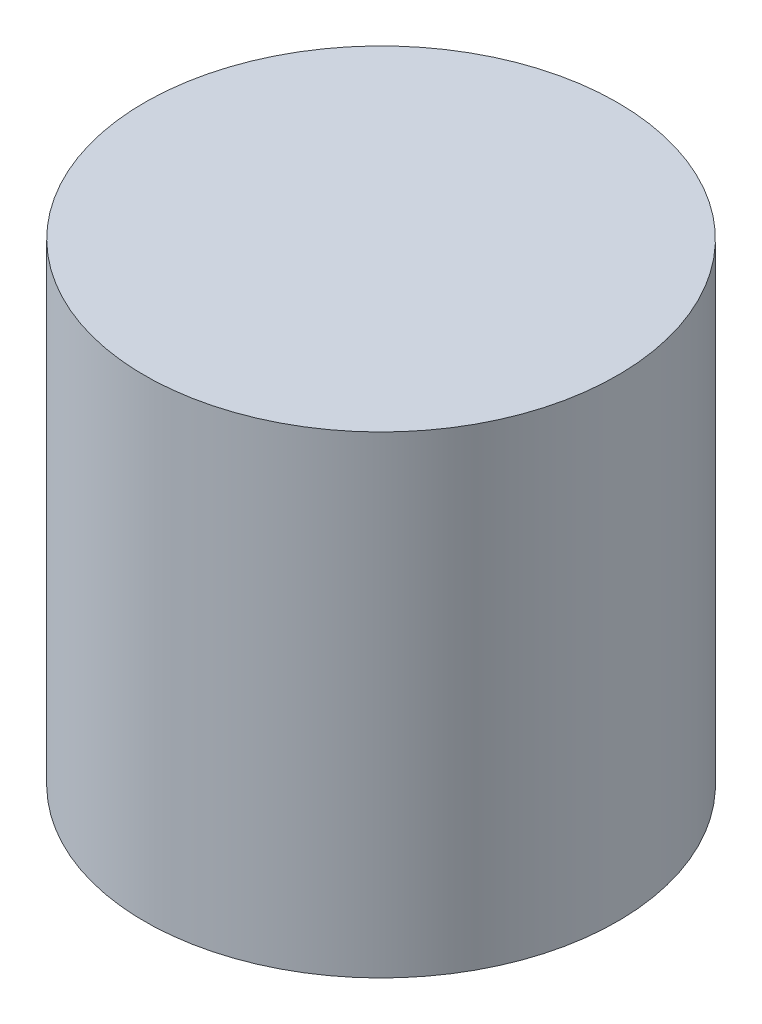
ISO-10303-21;
HEADER;
FILE_DESCRIPTION(('STEP AP214'),'2;1');
FILE_NAME('part.step','',(''),(''),'','','');
FILE_SCHEMA(('AUTOMOTIVE_DESIGN { 1 0 10303 214 1 1 1 1 }'));
ENDSEC;
DATA;
#1=APPLICATION_CONTEXT('core data for automotive mechanical design processes');
#2=APPLICATION_PROTOCOL_DEFINITION('international standard','automotive_design',2000,#1);
#3=PRODUCT_CONTEXT('',#1,'mechanical');
#4=PRODUCT('Part','Part','',(#3));
#5=PRODUCT_RELATED_PRODUCT_CATEGORY('part','',(#4));
#6=PRODUCT_DEFINITION_FORMATION('','',#4);
#7=PRODUCT_DEFINITION_CONTEXT('part definition',#1,'design');
#8=PRODUCT_DEFINITION('design','',#6,#7);
#9=PRODUCT_DEFINITION_SHAPE('','',#8);
#10=(LENGTH_UNIT() NAMED_UNIT(*) SI_UNIT(.MILLI.,.METRE.));
#11=(NAMED_UNIT(*) PLANE_ANGLE_UNIT() SI_UNIT($,.RADIAN.));
#12=(NAMED_UNIT(*) SI_UNIT($,.STERADIAN.) SOLID_ANGLE_UNIT());
#13=UNCERTAINTY_MEASURE_WITH_UNIT(LENGTH_MEASURE(1.E-05),#10,'distance_accuracy_value','');
#14=(GEOMETRIC_REPRESENTATION_CONTEXT(3) GLOBAL_UNCERTAINTY_ASSIGNED_CONTEXT((#13)) GLOBAL_UNIT_ASSIGNED_CONTEXT((#10,
#11,#12)) REPRESENTATION_CONTEXT('',''));
#15=CARTESIAN_POINT('',(0.,0.,0.));
#16=DIRECTION('',(0.,0.,1.));
#17=DIRECTION('',(1.,0.,0.));
#18=AXIS2_PLACEMENT_3D('',#15,#16,#17);
#19=CARTESIAN_POINT('',(70.645320736,-162.18583770811,44.3122539423846));
#20=DIRECTION('',(0.,1.,0.));
#21=DIRECTION('',(0.,0.,1.));
#22=AXIS2_PLACEMENT_3D('',#19,#20,#21);
#23=CYLINDRICAL_SURFACE('',#22,25.4);
#24=CARTESIAN_POINT('',(70.645320736,-162.18583770811,44.3122539423846));
#25=DIRECTION('',(0.,-1.,0.));
#26=DIRECTION('',(0.,0.,-1.));
#27=AXIS2_PLACEMENT_3D('',#24,#25,#26);
#28=CIRCLE('',#27,25.4);
#29=CARTESIAN_POINT('',(70.645320736,-162.18583770811,18.9122539423846));
#30=VERTEX_POINT('',#29);
#31=EDGE_CURVE('E10',#30,#30,#28,.T.);
#32=ORIENTED_EDGE('',*,*,#31,.F.);
#33=EDGE_LOOP('',(#32));
#34=FACE_BOUND('',#33,.T.);
#35=CARTESIAN_POINT('',(70.645320736,-111.38583770811,44.3122539423847));
#36=DIRECTION('',(0.,-1.,0.));
#37=DIRECTION('',(0.,0.,-1.));
#38=AXIS2_PLACEMENT_3D('',#35,#36,#37);
#39=CIRCLE('',#38,25.4);
#40=CARTESIAN_POINT('',(70.645320736,-111.38583770811,18.9122539423847));
#41=VERTEX_POINT('',#40);
#42=EDGE_CURVE('E32',#41,#41,#39,.T.);
#43=ORIENTED_EDGE('',*,*,#42,.T.);
#44=EDGE_LOOP('',(#43));
#45=FACE_BOUND('',#44,.T.);
#46=ADVANCED_FACE('F29',(#34,#45),#23,.T.);
#47=CARTESIAN_POINT('',(70.645320736,-162.18583770811,44.3122539423846));
#48=DIRECTION('',(0.,-1.,0.));
#49=DIRECTION('',(0.,0.,-1.));
#50=AXIS2_PLACEMENT_3D('',#47,#48,#49);
#51=PLANE('',#50);
#52=ORIENTED_EDGE('',*,*,#31,.T.);
#53=EDGE_LOOP('',(#52));
#54=FACE_BOUND('',#53,.T.);
#55=ADVANCED_FACE('F44',(#54),#51,.T.);
#56=CARTESIAN_POINT('',(70.645320736,-111.38583770811,44.3122539423847));
#57=DIRECTION('',(0.,-1.,0.));
#58=DIRECTION('',(0.,0.,-1.));
#59=AXIS2_PLACEMENT_3D('',#56,#57,#58);
#60=PLANE('',#59);
#61=ORIENTED_EDGE('',*,*,#42,.F.);
#62=EDGE_LOOP('',(#61));
#63=FACE_BOUND('',#62,.T.);
#64=ADVANCED_FACE('F42',(#63),#60,.F.);
#65=CLOSED_SHELL('',(#46,#55,#64));
#66=MANIFOLD_SOLID_BREP('B2',#65);
#67=ADVANCED_BREP_SHAPE_REPRESENTATION('',(#18,#66),#14);
#68=SHAPE_DEFINITION_REPRESENTATION(#9,#67);
ENDSEC;
END-ISO-10303-21;
